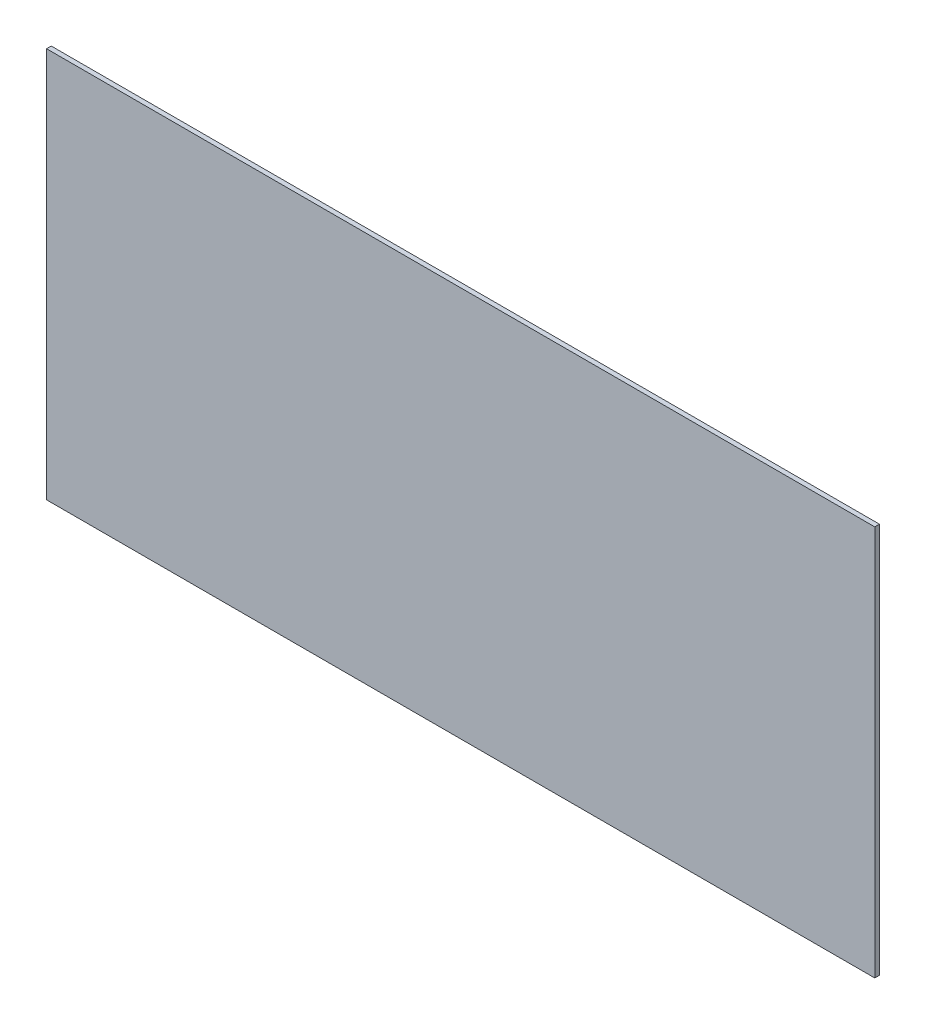
ISO-10303-21;
HEADER;
FILE_DESCRIPTION(('STEP AP214'),'2;1');
FILE_NAME('part.step','',(''),(''),'','','');
FILE_SCHEMA(('AUTOMOTIVE_DESIGN { 1 0 10303 214 1 1 1 1 }'));
ENDSEC;
DATA;
#1=APPLICATION_CONTEXT('core data for automotive mechanical design processes');
#2=APPLICATION_PROTOCOL_DEFINITION('international standard','automotive_design',2000,#1);
#3=PRODUCT_CONTEXT('',#1,'mechanical');
#4=PRODUCT('Part','Part','',(#3));
#5=PRODUCT_RELATED_PRODUCT_CATEGORY('part','',(#4));
#6=PRODUCT_DEFINITION_FORMATION('','',#4);
#7=PRODUCT_DEFINITION_CONTEXT('part definition',#1,'design');
#8=PRODUCT_DEFINITION('design','',#6,#7);
#9=PRODUCT_DEFINITION_SHAPE('','',#8);
#10=(LENGTH_UNIT() NAMED_UNIT(*) SI_UNIT(.MILLI.,.METRE.));
#11=(NAMED_UNIT(*) PLANE_ANGLE_UNIT() SI_UNIT($,.RADIAN.));
#12=(NAMED_UNIT(*) SI_UNIT($,.STERADIAN.) SOLID_ANGLE_UNIT());
#13=UNCERTAINTY_MEASURE_WITH_UNIT(LENGTH_MEASURE(1.E-05),#10,'distance_accuracy_value','');
#14=(GEOMETRIC_REPRESENTATION_CONTEXT(3) GLOBAL_UNCERTAINTY_ASSIGNED_CONTEXT((#13)) GLOBAL_UNIT_ASSIGNED_CONTEXT((#10,
#11,#12)) REPRESENTATION_CONTEXT('',''));
#15=CARTESIAN_POINT('',(0.,0.,0.));
#16=DIRECTION('',(0.,0.,1.));
#17=DIRECTION('',(1.,0.,0.));
#18=AXIS2_PLACEMENT_3D('',#15,#16,#17);
#19=CARTESIAN_POINT('',(265.,125.,3.));
#20=DIRECTION('',(-1.,0.,0.));
#21=DIRECTION('',(0.,0.,1.));
#22=AXIS2_PLACEMENT_3D('',#19,#20,#21);
#23=PLANE('',#22);
#24=DIRECTION('',(0.,1.,0.));
#25=VECTOR('',#24,1.);
#26=CARTESIAN_POINT('',(265.,125.,0.));
#27=LINE('',#26,#25);
#28=CARTESIAN_POINT('',(265.,-125.,0.));
#29=VERTEX_POINT('',#28);
#30=CARTESIAN_POINT('',(265.,125.,0.));
#31=VERTEX_POINT('',#30);
#32=EDGE_CURVE('E96',#29,#31,#27,.T.);
#33=ORIENTED_EDGE('',*,*,#32,.T.);
#34=DIRECTION('',(0.,0.,-1.));
#35=VECTOR('',#34,1.);
#36=CARTESIAN_POINT('',(265.,125.,3.));
#37=LINE('',#36,#35);
#38=CARTESIAN_POINT('',(265.,125.,3.));
#39=VERTEX_POINT('',#38);
#40=EDGE_CURVE('E11',#39,#31,#37,.T.);
#41=ORIENTED_EDGE('',*,*,#40,.F.);
#42=DIRECTION('',(0.,1.,0.));
#43=VECTOR('',#42,1.);
#44=CARTESIAN_POINT('',(265.,125.,3.));
#45=LINE('',#44,#43);
#46=CARTESIAN_POINT('',(265.,-125.,3.));
#47=VERTEX_POINT('',#46);
#48=EDGE_CURVE('E84',#47,#39,#45,.T.);
#49=ORIENTED_EDGE('',*,*,#48,.F.);
#50=DIRECTION('',(0.,0.,-1.));
#51=VECTOR('',#50,1.);
#52=CARTESIAN_POINT('',(265.,-125.,3.));
#53=LINE('',#52,#51);
#54=EDGE_CURVE('E92',#47,#29,#53,.T.);
#55=ORIENTED_EDGE('',*,*,#54,.T.);
#56=EDGE_LOOP('',(#33,#41,#49,#55));
#57=FACE_BOUND('',#56,.T.);
#58=ADVANCED_FACE('F33',(#57),#23,.F.);
#59=CARTESIAN_POINT('',(-265.,125.,3.));
#60=DIRECTION('',(0.,-1.,0.));
#61=DIRECTION('',(0.,0.,-1.));
#62=AXIS2_PLACEMENT_3D('',#59,#60,#61);
#63=PLANE('',#62);
#64=DIRECTION('',(-1.,0.,0.));
#65=VECTOR('',#64,1.);
#66=CARTESIAN_POINT('',(-265.,125.,0.));
#67=LINE('',#66,#65);
#68=CARTESIAN_POINT('',(-265.,125.,0.));
#69=VERTEX_POINT('',#68);
#70=EDGE_CURVE('E88',#31,#69,#67,.T.);
#71=ORIENTED_EDGE('',*,*,#70,.T.);
#72=DIRECTION('',(0.,0.,-1.));
#73=VECTOR('',#72,1.);
#74=CARTESIAN_POINT('',(-265.,125.,3.));
#75=LINE('',#74,#73);
#76=CARTESIAN_POINT('',(-265.,125.,3.));
#77=VERTEX_POINT('',#76);
#78=EDGE_CURVE('E41',#77,#69,#75,.T.);
#79=ORIENTED_EDGE('',*,*,#78,.F.);
#80=DIRECTION('',(-1.,0.,0.));
#81=VECTOR('',#80,1.);
#82=CARTESIAN_POINT('',(-265.,125.,3.));
#83=LINE('',#82,#81);
#84=EDGE_CURVE('E79',#39,#77,#83,.T.);
#85=ORIENTED_EDGE('',*,*,#84,.F.);
#86=ORIENTED_EDGE('',*,*,#40,.T.);
#87=EDGE_LOOP('',(#71,#79,#85,#86));
#88=FACE_BOUND('',#87,.T.);
#89=ADVANCED_FACE('F87',(#88),#63,.F.);
#90=CARTESIAN_POINT('',(-265.,125.,3.));
#91=DIRECTION('',(1.,0.,0.));
#92=DIRECTION('',(0.,1.,0.));
#93=AXIS2_PLACEMENT_3D('',#90,#91,#92);
#94=PLANE('',#93);
#95=DIRECTION('',(0.,-1.,0.));
#96=VECTOR('',#95,1.);
#97=CARTESIAN_POINT('',(-265.,125.,0.));
#98=LINE('',#97,#96);
#99=CARTESIAN_POINT('',(-265.,-125.,0.));
#100=VERTEX_POINT('',#99);
#101=EDGE_CURVE('E66',#69,#100,#98,.T.);
#102=ORIENTED_EDGE('',*,*,#101,.T.);
#103=DIRECTION('',(0.,0.,-1.));
#104=VECTOR('',#103,1.);
#105=CARTESIAN_POINT('',(-265.,-125.,3.));
#106=LINE('',#105,#104);
#107=CARTESIAN_POINT('',(-265.,-125.,3.));
#108=VERTEX_POINT('',#107);
#109=EDGE_CURVE('E89',#108,#100,#106,.T.);
#110=ORIENTED_EDGE('',*,*,#109,.F.);
#111=DIRECTION('',(0.,-1.,0.));
#112=VECTOR('',#111,1.);
#113=CARTESIAN_POINT('',(-265.,125.,3.));
#114=LINE('',#113,#112);
#115=EDGE_CURVE('E82',#77,#108,#114,.T.);
#116=ORIENTED_EDGE('',*,*,#115,.F.);
#117=ORIENTED_EDGE('',*,*,#78,.T.);
#118=EDGE_LOOP('',(#102,#110,#116,#117));
#119=FACE_BOUND('',#118,.T.);
#120=ADVANCED_FACE('F90',(#119),#94,.F.);
#121=CARTESIAN_POINT('',(-265.,-125.,3.));
#122=DIRECTION('',(0.,1.,0.));
#123=DIRECTION('',(0.,0.,1.));
#124=AXIS2_PLACEMENT_3D('',#121,#122,#123);
#125=PLANE('',#124);
#126=DIRECTION('',(1.,0.,0.));
#127=VECTOR('',#126,1.);
#128=CARTESIAN_POINT('',(-265.,-125.,0.));
#129=LINE('',#128,#127);
#130=EDGE_CURVE('E72',#100,#29,#129,.T.);
#131=ORIENTED_EDGE('',*,*,#130,.T.);
#132=ORIENTED_EDGE('',*,*,#54,.F.);
#133=DIRECTION('',(1.,0.,0.));
#134=VECTOR('',#133,1.);
#135=CARTESIAN_POINT('',(-265.,-125.,3.));
#136=LINE('',#135,#134);
#137=EDGE_CURVE('E49',#108,#47,#136,.T.);
#138=ORIENTED_EDGE('',*,*,#137,.F.);
#139=ORIENTED_EDGE('',*,*,#109,.T.);
#140=EDGE_LOOP('',(#131,#132,#138,#139));
#141=FACE_BOUND('',#140,.T.);
#142=ADVANCED_FACE('F103',(#141),#125,.F.);
#143=CARTESIAN_POINT('',(0.,0.,3.));
#144=DIRECTION('',(0.,0.,1.));
#145=DIRECTION('',(1.,0.,0.));
#146=AXIS2_PLACEMENT_3D('',#143,#144,#145);
#147=PLANE('',#146);
#148=ORIENTED_EDGE('',*,*,#48,.T.);
#149=ORIENTED_EDGE('',*,*,#84,.T.);
#150=ORIENTED_EDGE('',*,*,#115,.T.);
#151=ORIENTED_EDGE('',*,*,#137,.T.);
#152=EDGE_LOOP('',(#148,#149,#150,#151));
#153=FACE_BOUND('',#152,.T.);
#154=ADVANCED_FACE('F80',(#153),#147,.T.);
#155=CARTESIAN_POINT('',(0.,0.,0.));
#156=DIRECTION('',(0.,0.,1.));
#157=DIRECTION('',(1.,0.,0.));
#158=AXIS2_PLACEMENT_3D('',#155,#156,#157);
#159=PLANE('',#158);
#160=ORIENTED_EDGE('',*,*,#32,.F.);
#161=ORIENTED_EDGE('',*,*,#130,.F.);
#162=ORIENTED_EDGE('',*,*,#101,.F.);
#163=ORIENTED_EDGE('',*,*,#70,.F.);
#164=EDGE_LOOP('',(#160,#161,#162,#163));
#165=FACE_BOUND('',#164,.T.);
#166=ADVANCED_FACE('F106',(#165),#159,.F.);
#167=CLOSED_SHELL('',(#58,#89,#120,#142,#154,#166));
#168=MANIFOLD_SOLID_BREP('B2',#167);
#169=ADVANCED_BREP_SHAPE_REPRESENTATION('',(#18,#168),#14);
#170=SHAPE_DEFINITION_REPRESENTATION(#9,#169);
ENDSEC;
END-ISO-10303-21;
